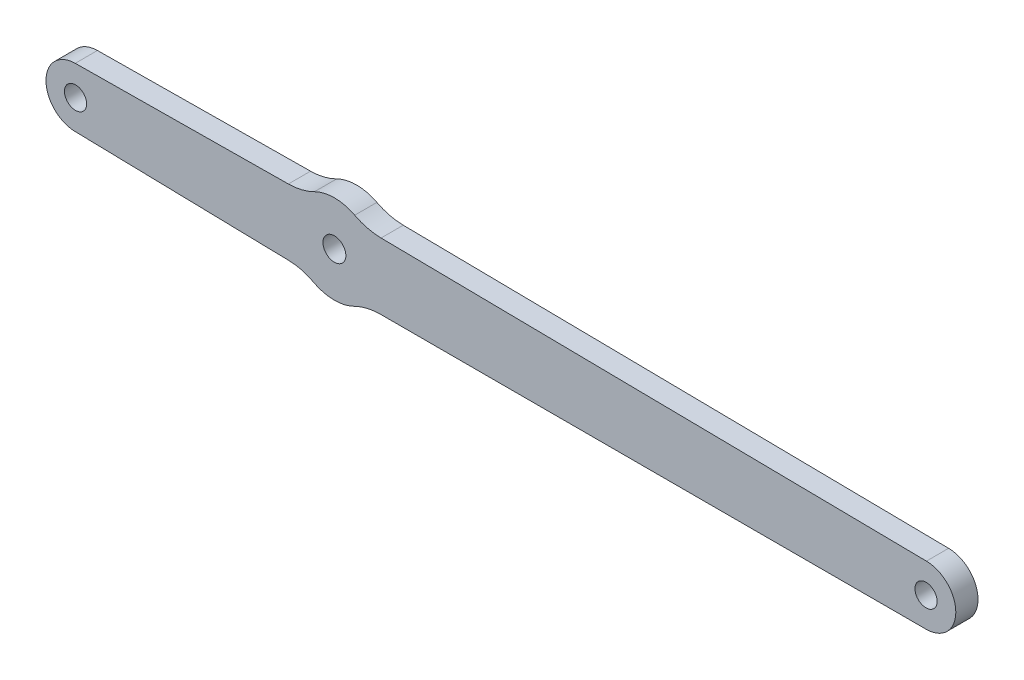
ISO-10303-21;
HEADER;
FILE_DESCRIPTION(('STEP AP214'),'2;1');
FILE_NAME('part.step','',(''),(''),'','','');
FILE_SCHEMA(('AUTOMOTIVE_DESIGN { 1 0 10303 214 1 1 1 1 }'));
ENDSEC;
DATA;
#1=APPLICATION_CONTEXT('core data for automotive mechanical design processes');
#2=APPLICATION_PROTOCOL_DEFINITION('international standard','automotive_design',2000,#1);
#3=PRODUCT_CONTEXT('',#1,'mechanical');
#4=PRODUCT('Part','Part','',(#3));
#5=PRODUCT_RELATED_PRODUCT_CATEGORY('part','',(#4));
#6=PRODUCT_DEFINITION_FORMATION('','',#4);
#7=PRODUCT_DEFINITION_CONTEXT('part definition',#1,'design');
#8=PRODUCT_DEFINITION('design','',#6,#7);
#9=PRODUCT_DEFINITION_SHAPE('','',#8);
#10=(LENGTH_UNIT() NAMED_UNIT(*) SI_UNIT(.MILLI.,.METRE.));
#11=(NAMED_UNIT(*) PLANE_ANGLE_UNIT() SI_UNIT($,.RADIAN.));
#12=(NAMED_UNIT(*) SI_UNIT($,.STERADIAN.) SOLID_ANGLE_UNIT());
#13=UNCERTAINTY_MEASURE_WITH_UNIT(LENGTH_MEASURE(1.E-05),#10,'distance_accuracy_value','');
#14=(GEOMETRIC_REPRESENTATION_CONTEXT(3) GLOBAL_UNCERTAINTY_ASSIGNED_CONTEXT((#13)) GLOBAL_UNIT_ASSIGNED_CONTEXT((#10,
#11,#12)) REPRESENTATION_CONTEXT('',''));
#15=CARTESIAN_POINT('',(0.,0.,0.));
#16=DIRECTION('',(0.,0.,1.));
#17=DIRECTION('',(1.,0.,0.));
#18=AXIS2_PLACEMENT_3D('',#15,#16,#17);
#19=CARTESIAN_POINT('',(33.0635943478881,25.0470070035861,3.));
#20=DIRECTION('',(0.,0.,1.));
#21=DIRECTION('',(1.,0.,0.));
#22=AXIS2_PLACEMENT_3D('',#19,#20,#21);
#23=PLANE('',#22);
#24=CARTESIAN_POINT('',(148.061172710438,24.2977983005144,3.));
#25=DIRECTION('',(0.,0.,1.));
#26=DIRECTION('',(1.,0.,0.));
#27=AXIS2_PLACEMENT_3D('',#24,#25,#26);
#28=CIRCLE('',#27,1.49995000083339);
#29=CARTESIAN_POINT('',(149.561122711271,24.2977983005144,3.));
#30=VERTEX_POINT('',#29);
#31=EDGE_CURVE('E286',#30,#30,#28,.T.);
#32=ORIENTED_EDGE('',*,*,#31,.F.);
#33=EDGE_LOOP('',(#32));
#34=FACE_BOUND('',#33,.T.);
#35=CARTESIAN_POINT('',(33.0635943478881,25.0470070035861,3.));
#36=DIRECTION('',(0.,0.,1.));
#37=DIRECTION('',(1.,0.,0.));
#38=AXIS2_PLACEMENT_3D('',#35,#36,#37);
#39=CIRCLE('',#38,4.00000361317352);
#40=CARTESIAN_POINT('',(33.0253301034182,29.0468275936871,3.));
#41=VERTEX_POINT('',#40);
#42=CARTESIAN_POINT('',(32.9732245399927,21.0480243575594,3.));
#43=VERTEX_POINT('',#42);
#44=EDGE_CURVE('E177',#41,#43,#39,.T.);
#45=ORIENTED_EDGE('',*,*,#44,.T.);
#46=DIRECTION('',(0.999744437235561,-0.0226066409833672,0.));
#47=VECTOR('',#46,1.);
#48=CARTESIAN_POINT('',(32.9732245399927,21.0480243575594,3.));
#49=LINE('',#48,#47);
#50=CARTESIAN_POINT('',(61.783565293031,20.3965528356839,3.));
#51=VERTEX_POINT('',#50);
#52=EDGE_CURVE('E105',#43,#51,#49,.T.);
#53=ORIENTED_EDGE('',*,*,#52,.T.);
#54=CARTESIAN_POINT('',(61.7190037352199,12.8520930673461,3.));
#55=DIRECTION('',(0.,0.,-1.));
#56=DIRECTION('',(1.,0.,0.));
#57=AXIS2_PLACEMENT_3D('',#54,#55,#56);
#58=CIRCLE('',#57,7.54473600537584);
#59=CARTESIAN_POINT('',(65.2942771692369,19.4959218778158,3.));
#60=VERTEX_POINT('',#59);
#61=EDGE_CURVE('E204',#51,#60,#58,.T.);
#62=ORIENTED_EDGE('',*,*,#61,.T.);
#63=CARTESIAN_POINT('',(68.0628395059717,24.819018292042,3.));
#64=DIRECTION('',(0.,0.,1.));
#65=DIRECTION('',(1.,0.,0.));
#66=AXIS2_PLACEMENT_3D('',#63,#64,#65);
#67=CIRCLE('',#66,6.00002440391159);
#68=CARTESIAN_POINT('',(70.7430546051185,19.4508957273235,3.));
#69=VERTEX_POINT('',#68);
#70=EDGE_CURVE('E223',#60,#69,#67,.T.);
#71=ORIENTED_EDGE('',*,*,#70,.T.);
#72=CARTESIAN_POINT('',(74.3167478855792,12.2927739145286,3.));
#73=DIRECTION('',(0.,0.,-1.));
#74=DIRECTION('',(1.,0.,0.));
#75=AXIS2_PLACEMENT_3D('',#72,#73,#74);
#76=CIRCLE('',#75,8.00062444748034);
#77=CARTESIAN_POINT('',(74.3160887340208,20.293398334856,3.));
#78=VERTEX_POINT('',#77);
#79=EDGE_CURVE('E220',#69,#78,#76,.T.);
#80=ORIENTED_EDGE('',*,*,#79,.T.);
#81=DIRECTION('',(0.99999999821744,5.97086335315886E-05,0.));
#82=VECTOR('',#81,1.);
#83=CARTESIAN_POINT('',(74.3160887340208,20.293398334856,3.));
#84=LINE('',#83,#82);
#85=CARTESIAN_POINT('',(148.061464315826,20.2978015704691,3.));
#86=VERTEX_POINT('',#85);
#87=EDGE_CURVE('E222',#78,#86,#84,.T.);
#88=ORIENTED_EDGE('',*,*,#87,.T.);
#89=CARTESIAN_POINT('',(148.087522333438,24.297603154264,3.));
#90=DIRECTION('',(0.,0.,1.));
#91=DIRECTION('',(1.,0.,0.));
#92=AXIS2_PLACEMENT_3D('',#89,#90,#91);
#93=CIRCLE('',#92,3.99988646463997);
#94=CARTESIAN_POINT('',(148.11358035105,28.2974047380589,3.));
#95=VERTEX_POINT('',#94);
#96=EDGE_CURVE('E225',#86,#95,#93,.T.);
#97=ORIENTED_EDGE('',*,*,#96,.T.);
#98=DIRECTION('',(-0.999914327574007,0.0130895955713525,0.));
#99=VECTOR('',#98,1.);
#100=CARTESIAN_POINT('',(74.3744982982912,29.2627021993076,3.));
#101=LINE('',#100,#99);
#102=CARTESIAN_POINT('',(74.3744982982912,29.2627021993076,3.));
#103=VERTEX_POINT('',#102);
#104=EDGE_CURVE('E231',#95,#103,#101,.T.);
#105=ORIENTED_EDGE('',*,*,#104,.T.);
#106=CARTESIAN_POINT('',(74.4794155751999,37.2626586982,3.));
#107=DIRECTION('',(0.,0.,-1.));
#108=DIRECTION('',(1.,0.,0.));
#109=AXIS2_PLACEMENT_3D('',#106,#107,#108);
#110=CIRCLE('',#109,8.00064445024052);
#111=CARTESIAN_POINT('',(70.8127297807471,30.1517004713558,3.));
#112=VERTEX_POINT('',#111);
#113=EDGE_CURVE('E136',#103,#112,#110,.T.);
#114=ORIENTED_EDGE('',*,*,#113,.T.);
#115=CARTESIAN_POINT('',(68.0628326353952,24.8193619877973,3.));
#116=DIRECTION('',(0.,0.,1.));
#117=DIRECTION('',(1.,0.,0.));
#118=AXIS2_PLACEMENT_3D('',#115,#116,#117);
#119=CIRCLE('',#118,5.99964732407278);
#120=CARTESIAN_POINT('',(65.3638023250229,30.1776269492326,3.));
#121=VERTEX_POINT('',#120);
#122=EDGE_CURVE('E130',#112,#121,#119,.T.);
#123=ORIENTED_EDGE('',*,*,#122,.T.);
#124=CARTESIAN_POINT('',(61.7610246332132,37.3391189335811,3.));
#125=DIRECTION('',(0.,0.,-1.));
#126=DIRECTION('',(1.,0.,0.));
#127=AXIS2_PLACEMENT_3D('',#124,#125,#126);
#128=CIRCLE('',#127,8.01666854363387);
#129=CARTESIAN_POINT('',(61.841711978951,29.3228564571693,3.));
#130=VERTEX_POINT('',#129);
#131=EDGE_CURVE('E134',#121,#130,#128,.T.);
#132=ORIENTED_EDGE('',*,*,#131,.T.);
#133=DIRECTION('',(-0.999954125619551,-0.00957844749633484,0.));
#134=VECTOR('',#133,1.);
#135=CARTESIAN_POINT('',(33.0253301034182,29.0468275936871,3.));
#136=LINE('',#135,#134);
#137=EDGE_CURVE('E50',#130,#41,#136,.T.);
#138=ORIENTED_EDGE('',*,*,#137,.T.);
#139=EDGE_LOOP('',(#45,#53,#62,#71,#80,#88,#97,#105,#114,#123,#132,#138));
#140=FACE_BOUND('',#139,.T.);
#141=CARTESIAN_POINT('',(68.0628917971342,24.8190378746937,3.));
#142=DIRECTION('',(0.,0.,1.));
#143=DIRECTION('',(1.,0.,0.));
#144=AXIS2_PLACEMENT_3D('',#141,#142,#143);
#145=CIRCLE('',#144,1.55000000161283);
#146=CARTESIAN_POINT('',(69.6128917987471,24.8190378746937,3.));
#147=VERTEX_POINT('',#146);
#148=EDGE_CURVE('E158',#147,#147,#145,.T.);
#149=ORIENTED_EDGE('',*,*,#148,.F.);
#150=EDGE_LOOP('',(#149));
#151=FACE_BOUND('',#150,.T.);
#152=CARTESIAN_POINT('',(33.0635943478881,25.0470070035861,3.));
#153=DIRECTION('',(0.,0.,1.));
#154=DIRECTION('',(1.,0.,0.));
#155=AXIS2_PLACEMENT_3D('',#152,#153,#154);
#156=CIRCLE('',#155,1.49995000083339);
#157=CARTESIAN_POINT('',(34.5635443487215,25.0470070035861,3.));
#158=VERTEX_POINT('',#157);
#159=EDGE_CURVE('E277',#158,#158,#156,.T.);
#160=ORIENTED_EDGE('',*,*,#159,.F.);
#161=EDGE_LOOP('',(#160));
#162=FACE_BOUND('',#161,.T.);
#163=ADVANCED_FACE('F33',(#34,#140,#151,#162),#23,.T.);
#164=CARTESIAN_POINT('',(33.0635943478881,25.0470070035861,0.));
#165=DIRECTION('',(0.,0.,1.));
#166=DIRECTION('',(1.,0.,0.));
#167=AXIS2_PLACEMENT_3D('',#164,#165,#166);
#168=PLANE('',#167);
#169=CARTESIAN_POINT('',(33.0635943478881,25.0470070035861,0.));
#170=DIRECTION('',(0.,0.,1.));
#171=DIRECTION('',(1.,0.,0.));
#172=AXIS2_PLACEMENT_3D('',#169,#170,#171);
#173=CIRCLE('',#172,4.00000361317352);
#174=CARTESIAN_POINT('',(33.0253301034182,29.0468275936871,0.));
#175=VERTEX_POINT('',#174);
#176=CARTESIAN_POINT('',(32.9732245399927,21.0480243575594,0.));
#177=VERTEX_POINT('',#176);
#178=EDGE_CURVE('E154',#175,#177,#173,.T.);
#179=ORIENTED_EDGE('',*,*,#178,.F.);
#180=DIRECTION('',(-0.999954125619551,-0.00957844749633484,0.));
#181=VECTOR('',#180,1.);
#182=CARTESIAN_POINT('',(33.0253301034182,29.0468275936871,0.));
#183=LINE('',#182,#181);
#184=CARTESIAN_POINT('',(61.841711978951,29.3228564571693,0.));
#185=VERTEX_POINT('',#184);
#186=EDGE_CURVE('E97',#185,#175,#183,.T.);
#187=ORIENTED_EDGE('',*,*,#186,.F.);
#188=CARTESIAN_POINT('',(61.7610246332132,37.3391189335811,0.));
#189=DIRECTION('',(0.,0.,-1.));
#190=DIRECTION('',(1.,0.,0.));
#191=AXIS2_PLACEMENT_3D('',#188,#189,#190);
#192=CIRCLE('',#191,8.01666854363387);
#193=CARTESIAN_POINT('',(65.3638023250229,30.1776269492326,0.));
#194=VERTEX_POINT('',#193);
#195=EDGE_CURVE('E91',#194,#185,#192,.T.);
#196=ORIENTED_EDGE('',*,*,#195,.F.);
#197=CARTESIAN_POINT('',(68.0628326353952,24.8193619877973,0.));
#198=DIRECTION('',(0.,0.,1.));
#199=DIRECTION('',(1.,0.,0.));
#200=AXIS2_PLACEMENT_3D('',#197,#198,#199);
#201=CIRCLE('',#200,5.99964732407278);
#202=CARTESIAN_POINT('',(70.8127297807471,30.1517004713558,0.));
#203=VERTEX_POINT('',#202);
#204=EDGE_CURVE('E144',#203,#194,#201,.T.);
#205=ORIENTED_EDGE('',*,*,#204,.F.);
#206=CARTESIAN_POINT('',(74.4794155751999,37.2626586982,0.));
#207=DIRECTION('',(0.,0.,-1.));
#208=DIRECTION('',(1.,0.,0.));
#209=AXIS2_PLACEMENT_3D('',#206,#207,#208);
#210=CIRCLE('',#209,8.00064445024052);
#211=CARTESIAN_POINT('',(74.3744982982912,29.2627021993076,0.));
#212=VERTEX_POINT('',#211);
#213=EDGE_CURVE('E172',#212,#203,#210,.T.);
#214=ORIENTED_EDGE('',*,*,#213,.F.);
#215=DIRECTION('',(-0.999914327574007,0.0130895955713525,0.));
#216=VECTOR('',#215,1.);
#217=CARTESIAN_POINT('',(74.3744982982912,29.2627021993076,0.));
#218=LINE('',#217,#216);
#219=CARTESIAN_POINT('',(148.11358035105,28.2974047380589,0.));
#220=VERTEX_POINT('',#219);
#221=EDGE_CURVE('E170',#220,#212,#218,.T.);
#222=ORIENTED_EDGE('',*,*,#221,.F.);
#223=CARTESIAN_POINT('',(148.087522333438,24.297603154264,0.));
#224=DIRECTION('',(0.,0.,1.));
#225=DIRECTION('',(1.,0.,0.));
#226=AXIS2_PLACEMENT_3D('',#223,#224,#225);
#227=CIRCLE('',#226,3.99988646463997);
#228=CARTESIAN_POINT('',(148.061464315826,20.2978015704691,0.));
#229=VERTEX_POINT('',#228);
#230=EDGE_CURVE('E168',#229,#220,#227,.T.);
#231=ORIENTED_EDGE('',*,*,#230,.F.);
#232=DIRECTION('',(0.99999999821744,5.97086335315886E-05,0.));
#233=VECTOR('',#232,1.);
#234=CARTESIAN_POINT('',(74.3160887340208,20.293398334856,0.));
#235=LINE('',#234,#233);
#236=CARTESIAN_POINT('',(74.3160887340208,20.293398334856,0.));
#237=VERTEX_POINT('',#236);
#238=EDGE_CURVE('E166',#237,#229,#235,.T.);
#239=ORIENTED_EDGE('',*,*,#238,.F.);
#240=CARTESIAN_POINT('',(74.3167478855792,12.2927739145286,0.));
#241=DIRECTION('',(0.,0.,-1.));
#242=DIRECTION('',(1.,0.,0.));
#243=AXIS2_PLACEMENT_3D('',#240,#241,#242);
#244=CIRCLE('',#243,8.00062444748034);
#245=CARTESIAN_POINT('',(70.7430546051185,19.4508957273235,0.));
#246=VERTEX_POINT('',#245);
#247=EDGE_CURVE('E164',#246,#237,#244,.T.);
#248=ORIENTED_EDGE('',*,*,#247,.F.);
#249=CARTESIAN_POINT('',(68.0628395059717,24.819018292042,0.));
#250=DIRECTION('',(0.,0.,1.));
#251=DIRECTION('',(1.,0.,0.));
#252=AXIS2_PLACEMENT_3D('',#249,#250,#251);
#253=CIRCLE('',#252,6.00002440391159);
#254=CARTESIAN_POINT('',(65.2942771692369,19.4959218778158,0.));
#255=VERTEX_POINT('',#254);
#256=EDGE_CURVE('E162',#255,#246,#253,.T.);
#257=ORIENTED_EDGE('',*,*,#256,.F.);
#258=CARTESIAN_POINT('',(61.7190037352199,12.8520930673461,0.));
#259=DIRECTION('',(0.,0.,-1.));
#260=DIRECTION('',(1.,0.,0.));
#261=AXIS2_PLACEMENT_3D('',#258,#259,#260);
#262=CIRCLE('',#261,7.54473600537584);
#263=CARTESIAN_POINT('',(61.783565293031,20.3965528356839,0.));
#264=VERTEX_POINT('',#263);
#265=EDGE_CURVE('E160',#264,#255,#262,.T.);
#266=ORIENTED_EDGE('',*,*,#265,.F.);
#267=DIRECTION('',(0.999744437235561,-0.0226066409833672,0.));
#268=VECTOR('',#267,1.);
#269=CARTESIAN_POINT('',(32.9732245399927,21.0480243575594,0.));
#270=LINE('',#269,#268);
#271=EDGE_CURVE('E157',#177,#264,#270,.T.);
#272=ORIENTED_EDGE('',*,*,#271,.F.);
#273=EDGE_LOOP('',(#179,#187,#196,#205,#214,#222,#231,#239,#248,#257,#266,#272));
#274=FACE_BOUND('',#273,.T.);
#275=CARTESIAN_POINT('',(68.0628917971342,24.8190378746937,0.));
#276=DIRECTION('',(0.,0.,1.));
#277=DIRECTION('',(1.,0.,0.));
#278=AXIS2_PLACEMENT_3D('',#275,#276,#277);
#279=CIRCLE('',#278,1.55000000161283);
#280=CARTESIAN_POINT('',(69.6128917987471,24.8190378746937,0.));
#281=VERTEX_POINT('',#280);
#282=EDGE_CURVE('E289',#281,#281,#279,.T.);
#283=ORIENTED_EDGE('',*,*,#282,.T.);
#284=EDGE_LOOP('',(#283));
#285=FACE_BOUND('',#284,.T.);
#286=CARTESIAN_POINT('',(148.061172710438,24.2977983005144,0.));
#287=DIRECTION('',(0.,0.,1.));
#288=DIRECTION('',(1.,0.,0.));
#289=AXIS2_PLACEMENT_3D('',#286,#287,#288);
#290=CIRCLE('',#289,1.49995000083339);
#291=CARTESIAN_POINT('',(149.561122711271,24.2977983005144,0.));
#292=VERTEX_POINT('',#291);
#293=EDGE_CURVE('E283',#292,#292,#290,.T.);
#294=ORIENTED_EDGE('',*,*,#293,.T.);
#295=EDGE_LOOP('',(#294));
#296=FACE_BOUND('',#295,.T.);
#297=CARTESIAN_POINT('',(33.0635943478881,25.0470070035861,0.));
#298=DIRECTION('',(0.,0.,1.));
#299=DIRECTION('',(1.,0.,0.));
#300=AXIS2_PLACEMENT_3D('',#297,#298,#299);
#301=CIRCLE('',#300,1.49995000083339);
#302=CARTESIAN_POINT('',(34.5635443487215,25.0470070035861,0.));
#303=VERTEX_POINT('',#302);
#304=EDGE_CURVE('E280',#303,#303,#301,.T.);
#305=ORIENTED_EDGE('',*,*,#304,.T.);
#306=EDGE_LOOP('',(#305));
#307=FACE_BOUND('',#306,.T.);
#308=ADVANCED_FACE('F208',(#274,#285,#296,#307),#168,.F.);
#309=CARTESIAN_POINT('',(33.0635943478881,25.0470070035861,3.));
#310=DIRECTION('',(0.,0.,-1.));
#311=DIRECTION('',(-1.,0.,0.));
#312=AXIS2_PLACEMENT_3D('',#309,#310,#311);
#313=CYLINDRICAL_SURFACE('',#312,4.00000361317352);
#314=ORIENTED_EDGE('',*,*,#178,.T.);
#315=DIRECTION('',(0.,0.,-1.));
#316=VECTOR('',#315,1.);
#317=CARTESIAN_POINT('',(32.9732245399927,21.0480243575594,3.));
#318=LINE('',#317,#316);
#319=EDGE_CURVE('E11',#43,#177,#318,.T.);
#320=ORIENTED_EDGE('',*,*,#319,.F.);
#321=ORIENTED_EDGE('',*,*,#44,.F.);
#322=DIRECTION('',(0.,0.,-1.));
#323=VECTOR('',#322,1.);
#324=CARTESIAN_POINT('',(33.0253301034182,29.0468275936871,3.));
#325=LINE('',#324,#323);
#326=EDGE_CURVE('E150',#41,#175,#325,.T.);
#327=ORIENTED_EDGE('',*,*,#326,.T.);
#328=EDGE_LOOP('',(#314,#320,#321,#327));
#329=FACE_BOUND('',#328,.T.);
#330=ADVANCED_FACE('F35',(#329),#313,.T.);
#331=CARTESIAN_POINT('',(32.9732245399927,21.0480243575594,3.));
#332=DIRECTION('',(0.0226066409833672,0.999744437235561,0.));
#333=DIRECTION('',(-0.999744437235561,0.0226066409833672,0.));
#334=AXIS2_PLACEMENT_3D('',#331,#332,#333);
#335=PLANE('',#334);
#336=ORIENTED_EDGE('',*,*,#271,.T.);
#337=DIRECTION('',(0.,0.,-1.));
#338=VECTOR('',#337,1.);
#339=CARTESIAN_POINT('',(61.783565293031,20.3965528356839,3.));
#340=LINE('',#339,#338);
#341=EDGE_CURVE('E42',#51,#264,#340,.T.);
#342=ORIENTED_EDGE('',*,*,#341,.F.);
#343=ORIENTED_EDGE('',*,*,#52,.F.);
#344=ORIENTED_EDGE('',*,*,#319,.T.);
#345=EDGE_LOOP('',(#336,#342,#343,#344));
#346=FACE_BOUND('',#345,.T.);
#347=ADVANCED_FACE('F391',(#346),#335,.F.);
#348=CARTESIAN_POINT('',(61.7190037352199,12.8520930673461,3.));
#349=DIRECTION('',(0.,0.,-1.));
#350=DIRECTION('',(-1.,0.,0.));
#351=AXIS2_PLACEMENT_3D('',#348,#349,#350);
#352=CYLINDRICAL_SURFACE('',#351,7.54473600537584);
#353=ORIENTED_EDGE('',*,*,#265,.T.);
#354=DIRECTION('',(0.,0.,-1.));
#355=VECTOR('',#354,1.);
#356=CARTESIAN_POINT('',(65.2942771692369,19.4959218778158,3.));
#357=LINE('',#356,#355);
#358=EDGE_CURVE('E196',#60,#255,#357,.T.);
#359=ORIENTED_EDGE('',*,*,#358,.F.);
#360=ORIENTED_EDGE('',*,*,#61,.F.);
#361=ORIENTED_EDGE('',*,*,#341,.T.);
#362=EDGE_LOOP('',(#353,#359,#360,#361));
#363=FACE_BOUND('',#362,.T.);
#364=ADVANCED_FACE('F202',(#363),#352,.F.);
#365=CARTESIAN_POINT('',(68.0628395059717,24.819018292042,3.));
#366=DIRECTION('',(0.,0.,-1.));
#367=DIRECTION('',(-1.,0.,0.));
#368=AXIS2_PLACEMENT_3D('',#365,#366,#367);
#369=CYLINDRICAL_SURFACE('',#368,6.00002440391159);
#370=ORIENTED_EDGE('',*,*,#256,.T.);
#371=DIRECTION('',(0.,0.,-1.));
#372=VECTOR('',#371,1.);
#373=CARTESIAN_POINT('',(70.7430546051185,19.4508957273235,3.));
#374=LINE('',#373,#372);
#375=EDGE_CURVE('E193',#69,#246,#374,.T.);
#376=ORIENTED_EDGE('',*,*,#375,.F.);
#377=ORIENTED_EDGE('',*,*,#70,.F.);
#378=ORIENTED_EDGE('',*,*,#358,.T.);
#379=EDGE_LOOP('',(#370,#376,#377,#378));
#380=FACE_BOUND('',#379,.T.);
#381=ADVANCED_FACE('F214',(#380),#369,.T.);
#382=CARTESIAN_POINT('',(74.3167478855792,12.2927739145286,3.));
#383=DIRECTION('',(0.,0.,-1.));
#384=DIRECTION('',(-1.,0.,0.));
#385=AXIS2_PLACEMENT_3D('',#382,#383,#384);
#386=CYLINDRICAL_SURFACE('',#385,8.00062444748034);
#387=ORIENTED_EDGE('',*,*,#247,.T.);
#388=DIRECTION('',(0.,0.,-1.));
#389=VECTOR('',#388,1.);
#390=CARTESIAN_POINT('',(74.3160887340208,20.293398334856,3.));
#391=LINE('',#390,#389);
#392=EDGE_CURVE('E190',#78,#237,#391,.T.);
#393=ORIENTED_EDGE('',*,*,#392,.F.);
#394=ORIENTED_EDGE('',*,*,#79,.F.);
#395=ORIENTED_EDGE('',*,*,#375,.T.);
#396=EDGE_LOOP('',(#387,#393,#394,#395));
#397=FACE_BOUND('',#396,.T.);
#398=ADVANCED_FACE('F218',(#397),#386,.F.);
#399=CARTESIAN_POINT('',(74.3160887340208,20.293398334856,3.));
#400=DIRECTION('',(-5.97086335315886E-05,0.99999999821744,0.));
#401=DIRECTION('',(-0.99999999821744,-5.97086335315886E-05,0.));
#402=AXIS2_PLACEMENT_3D('',#399,#400,#401);
#403=PLANE('',#402);
#404=ORIENTED_EDGE('',*,*,#238,.T.);
#405=DIRECTION('',(0.,0.,-1.));
#406=VECTOR('',#405,1.);
#407=CARTESIAN_POINT('',(148.061464315826,20.2978015704691,3.));
#408=LINE('',#407,#406);
#409=EDGE_CURVE('E187',#86,#229,#408,.T.);
#410=ORIENTED_EDGE('',*,*,#409,.F.);
#411=ORIENTED_EDGE('',*,*,#87,.F.);
#412=ORIENTED_EDGE('',*,*,#392,.T.);
#413=EDGE_LOOP('',(#404,#410,#411,#412));
#414=FACE_BOUND('',#413,.T.);
#415=ADVANCED_FACE('F356',(#414),#403,.F.);
#416=CARTESIAN_POINT('',(148.087522333438,24.297603154264,3.));
#417=DIRECTION('',(0.,0.,-1.));
#418=DIRECTION('',(-1.,0.,0.));
#419=AXIS2_PLACEMENT_3D('',#416,#417,#418);
#420=CYLINDRICAL_SURFACE('',#419,3.99988646463997);
#421=ORIENTED_EDGE('',*,*,#230,.T.);
#422=DIRECTION('',(0.,0.,-1.));
#423=VECTOR('',#422,1.);
#424=CARTESIAN_POINT('',(148.11358035105,28.2974047380589,3.));
#425=LINE('',#424,#423);
#426=EDGE_CURVE('E184',#95,#220,#425,.T.);
#427=ORIENTED_EDGE('',*,*,#426,.F.);
#428=ORIENTED_EDGE('',*,*,#96,.F.);
#429=ORIENTED_EDGE('',*,*,#409,.T.);
#430=EDGE_LOOP('',(#421,#427,#428,#429));
#431=FACE_BOUND('',#430,.T.);
#432=ADVANCED_FACE('F347',(#431),#420,.T.);
#433=CARTESIAN_POINT('',(74.3744982982912,29.2627021993076,3.));
#434=DIRECTION('',(-0.0130895955713525,-0.999914327574007,0.));
#435=DIRECTION('',(0.999914327574007,-0.0130895955713525,0.));
#436=AXIS2_PLACEMENT_3D('',#433,#434,#435);
#437=PLANE('',#436);
#438=ORIENTED_EDGE('',*,*,#221,.T.);
#439=DIRECTION('',(0.,0.,-1.));
#440=VECTOR('',#439,1.);
#441=CARTESIAN_POINT('',(74.3744982982912,29.2627021993076,3.));
#442=LINE('',#441,#440);
#443=EDGE_CURVE('E181',#103,#212,#442,.T.);
#444=ORIENTED_EDGE('',*,*,#443,.F.);
#445=ORIENTED_EDGE('',*,*,#104,.F.);
#446=ORIENTED_EDGE('',*,*,#426,.T.);
#447=EDGE_LOOP('',(#438,#444,#445,#446));
#448=FACE_BOUND('',#447,.T.);
#449=ADVANCED_FACE('F237',(#448),#437,.F.);
#450=CARTESIAN_POINT('',(74.4794155751999,37.2626586982,3.));
#451=DIRECTION('',(0.,0.,-1.));
#452=DIRECTION('',(-1.,0.,0.));
#453=AXIS2_PLACEMENT_3D('',#450,#451,#452);
#454=CYLINDRICAL_SURFACE('',#453,8.00064445024052);
#455=ORIENTED_EDGE('',*,*,#213,.T.);
#456=DIRECTION('',(0.,0.,-1.));
#457=VECTOR('',#456,1.);
#458=CARTESIAN_POINT('',(70.8127297807471,30.1517004713558,3.));
#459=LINE('',#458,#457);
#460=EDGE_CURVE('E145',#112,#203,#459,.T.);
#461=ORIENTED_EDGE('',*,*,#460,.F.);
#462=ORIENTED_EDGE('',*,*,#113,.F.);
#463=ORIENTED_EDGE('',*,*,#443,.T.);
#464=EDGE_LOOP('',(#455,#461,#462,#463));
#465=FACE_BOUND('',#464,.T.);
#466=ADVANCED_FACE('F241',(#465),#454,.F.);
#467=CARTESIAN_POINT('',(68.0628326353952,24.8193619877973,3.));
#468=DIRECTION('',(0.,0.,-1.));
#469=DIRECTION('',(-1.,0.,0.));
#470=AXIS2_PLACEMENT_3D('',#467,#468,#469);
#471=CYLINDRICAL_SURFACE('',#470,5.99964732407278);
#472=ORIENTED_EDGE('',*,*,#204,.T.);
#473=DIRECTION('',(0.,0.,-1.));
#474=VECTOR('',#473,1.);
#475=CARTESIAN_POINT('',(65.3638023250229,30.1776269492326,3.));
#476=LINE('',#475,#474);
#477=EDGE_CURVE('E141',#121,#194,#476,.T.);
#478=ORIENTED_EDGE('',*,*,#477,.F.);
#479=ORIENTED_EDGE('',*,*,#122,.F.);
#480=ORIENTED_EDGE('',*,*,#460,.T.);
#481=EDGE_LOOP('',(#472,#478,#479,#480));
#482=FACE_BOUND('',#481,.T.);
#483=ADVANCED_FACE('F142',(#482),#471,.T.);
#484=CARTESIAN_POINT('',(61.7610246332132,37.3391189335811,3.));
#485=DIRECTION('',(0.,0.,-1.));
#486=DIRECTION('',(-1.,0.,0.));
#487=AXIS2_PLACEMENT_3D('',#484,#485,#486);
#488=CYLINDRICAL_SURFACE('',#487,8.01666854363387);
#489=ORIENTED_EDGE('',*,*,#195,.T.);
#490=DIRECTION('',(0.,0.,-1.));
#491=VECTOR('',#490,1.);
#492=CARTESIAN_POINT('',(61.841711978951,29.3228564571693,3.));
#493=LINE('',#492,#491);
#494=EDGE_CURVE('E146',#130,#185,#493,.T.);
#495=ORIENTED_EDGE('',*,*,#494,.F.);
#496=ORIENTED_EDGE('',*,*,#131,.F.);
#497=ORIENTED_EDGE('',*,*,#477,.T.);
#498=EDGE_LOOP('',(#489,#495,#496,#497));
#499=FACE_BOUND('',#498,.T.);
#500=ADVANCED_FACE('F148',(#499),#488,.F.);
#501=CARTESIAN_POINT('',(33.0253301034182,29.0468275936871,3.));
#502=DIRECTION('',(0.00957844749633484,-0.999954125619551,0.));
#503=DIRECTION('',(0.999954125619551,0.00957844749633484,0.));
#504=AXIS2_PLACEMENT_3D('',#501,#502,#503);
#505=PLANE('',#504);
#506=ORIENTED_EDGE('',*,*,#186,.T.);
#507=ORIENTED_EDGE('',*,*,#326,.F.);
#508=ORIENTED_EDGE('',*,*,#137,.F.);
#509=ORIENTED_EDGE('',*,*,#494,.T.);
#510=EDGE_LOOP('',(#506,#507,#508,#509));
#511=FACE_BOUND('',#510,.T.);
#512=ADVANCED_FACE('F245',(#511),#505,.F.);
#513=CARTESIAN_POINT('',(68.0628917971342,24.8190378746937,3.));
#514=DIRECTION('',(0.,0.,-1.));
#515=DIRECTION('',(-1.,0.,0.));
#516=AXIS2_PLACEMENT_3D('',#513,#514,#515);
#517=CYLINDRICAL_SURFACE('',#516,1.55000000161283);
#518=ORIENTED_EDGE('',*,*,#148,.T.);
#519=EDGE_LOOP('',(#518));
#520=FACE_BOUND('',#519,.T.);
#521=ORIENTED_EDGE('',*,*,#282,.F.);
#522=EDGE_LOOP('',(#521));
#523=FACE_BOUND('',#522,.T.);
#524=ADVANCED_FACE('F247',(#520,#523),#517,.F.);
#525=CARTESIAN_POINT('',(148.061172710438,24.2977983005144,3.));
#526=DIRECTION('',(0.,0.,-1.));
#527=DIRECTION('',(-1.,0.,0.));
#528=AXIS2_PLACEMENT_3D('',#525,#526,#527);
#529=CYLINDRICAL_SURFACE('',#528,1.49995000083339);
#530=ORIENTED_EDGE('',*,*,#31,.T.);
#531=EDGE_LOOP('',(#530));
#532=FACE_BOUND('',#531,.T.);
#533=ORIENTED_EDGE('',*,*,#293,.F.);
#534=EDGE_LOOP('',(#533));
#535=FACE_BOUND('',#534,.T.);
#536=ADVANCED_FACE('F253',(#532,#535),#529,.F.);
#537=CARTESIAN_POINT('',(33.0635943478881,25.0470070035861,3.));
#538=DIRECTION('',(0.,0.,-1.));
#539=DIRECTION('',(-1.,0.,0.));
#540=AXIS2_PLACEMENT_3D('',#537,#538,#539);
#541=CYLINDRICAL_SURFACE('',#540,1.49995000083339);
#542=ORIENTED_EDGE('',*,*,#159,.T.);
#543=EDGE_LOOP('',(#542));
#544=FACE_BOUND('',#543,.T.);
#545=ORIENTED_EDGE('',*,*,#304,.F.);
#546=EDGE_LOOP('',(#545));
#547=FACE_BOUND('',#546,.T.);
#548=ADVANCED_FACE('F268',(#544,#547),#541,.F.);
#549=CLOSED_SHELL('',(#163,#308,#330,#347,#364,#381,#398,#415,#432,#449,#466,#483,#500,#512,
#524,#536,#548));
#550=MANIFOLD_SOLID_BREP('B2',#549);
#551=ADVANCED_BREP_SHAPE_REPRESENTATION('',(#18,#550),#14);
#552=SHAPE_DEFINITION_REPRESENTATION(#9,#551);
ENDSEC;
END-ISO-10303-21;
